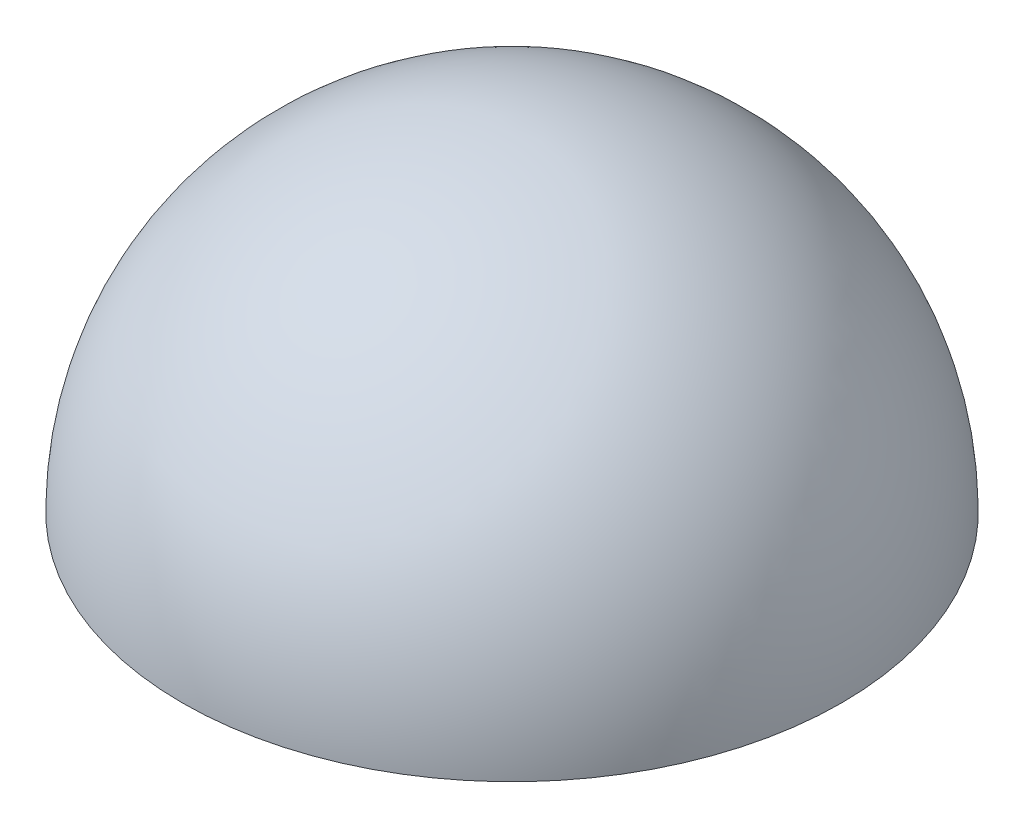
ISO-10303-21;
HEADER;
FILE_DESCRIPTION(('STEP AP214'),'2;1');
FILE_NAME('part.step','',(''),(''),'','','');
FILE_SCHEMA(('AUTOMOTIVE_DESIGN { 1 0 10303 214 1 1 1 1 }'));
ENDSEC;
DATA;
#1=APPLICATION_CONTEXT('core data for automotive mechanical design processes');
#2=APPLICATION_PROTOCOL_DEFINITION('international standard','automotive_design',2000,#1);
#3=PRODUCT_CONTEXT('',#1,'mechanical');
#4=PRODUCT('Part','Part','',(#3));
#5=PRODUCT_RELATED_PRODUCT_CATEGORY('part','',(#4));
#6=PRODUCT_DEFINITION_FORMATION('','',#4);
#7=PRODUCT_DEFINITION_CONTEXT('part definition',#1,'design');
#8=PRODUCT_DEFINITION('design','',#6,#7);
#9=PRODUCT_DEFINITION_SHAPE('','',#8);
#10=(LENGTH_UNIT() NAMED_UNIT(*) SI_UNIT(.MILLI.,.METRE.));
#11=(NAMED_UNIT(*) PLANE_ANGLE_UNIT() SI_UNIT($,.RADIAN.));
#12=(NAMED_UNIT(*) SI_UNIT($,.STERADIAN.) SOLID_ANGLE_UNIT());
#13=UNCERTAINTY_MEASURE_WITH_UNIT(LENGTH_MEASURE(1.E-05),#10,'distance_accuracy_value','');
#14=(GEOMETRIC_REPRESENTATION_CONTEXT(3) GLOBAL_UNCERTAINTY_ASSIGNED_CONTEXT((#13)) GLOBAL_UNIT_ASSIGNED_CONTEXT((#10,
#11,#12)) REPRESENTATION_CONTEXT('',''));
#15=CARTESIAN_POINT('',(0.,0.,0.));
#16=DIRECTION('',(0.,0.,1.));
#17=DIRECTION('',(1.,0.,0.));
#18=AXIS2_PLACEMENT_3D('',#15,#16,#17);
#19=CARTESIAN_POINT('',(10.,0.,0.));
#20=DIRECTION('',(0.,1.,0.));
#21=DIRECTION('',(0.,0.,1.));
#22=AXIS2_PLACEMENT_3D('',#19,#20,#21);
#23=PLANE('',#22);
#24=CARTESIAN_POINT('',(0.,0.,0.));
#25=DIRECTION('',(0.,1.,0.));
#26=DIRECTION('',(0.,0.,1.));
#27=AXIS2_PLACEMENT_3D('',#24,#25,#26);
#28=CIRCLE('',#27,10.);
#29=CARTESIAN_POINT('',(0.,0.,10.));
#30=VERTEX_POINT('',#29);
#31=EDGE_CURVE('E10',#30,#30,#28,.T.);
#32=ORIENTED_EDGE('',*,*,#31,.F.);
#33=EDGE_LOOP('',(#32));
#34=FACE_BOUND('',#33,.T.);
#35=ADVANCED_FACE('F37',(#34),#23,.F.);
#36=CARTESIAN_POINT('',(0.,0.,0.));
#37=DIRECTION('',(0.,1.,0.));
#38=DIRECTION('',(1.,0.,0.));
#39=AXIS2_PLACEMENT_3D('',#36,#37,#38);
#40=SPHERICAL_SURFACE('',#39,10.);
#41=ORIENTED_EDGE('',*,*,#31,.T.);
#42=EDGE_LOOP('',(#41));
#43=FACE_BOUND('',#42,.T.);
#44=ADVANCED_FACE('F45',(#43),#40,.T.);
#45=CLOSED_SHELL('',(#35,#44));
#46=MANIFOLD_SOLID_BREP('B2',#45);
#47=ADVANCED_BREP_SHAPE_REPRESENTATION('',(#18,#46),#14);
#48=SHAPE_DEFINITION_REPRESENTATION(#9,#47);
ENDSEC;
END-ISO-10303-21;
